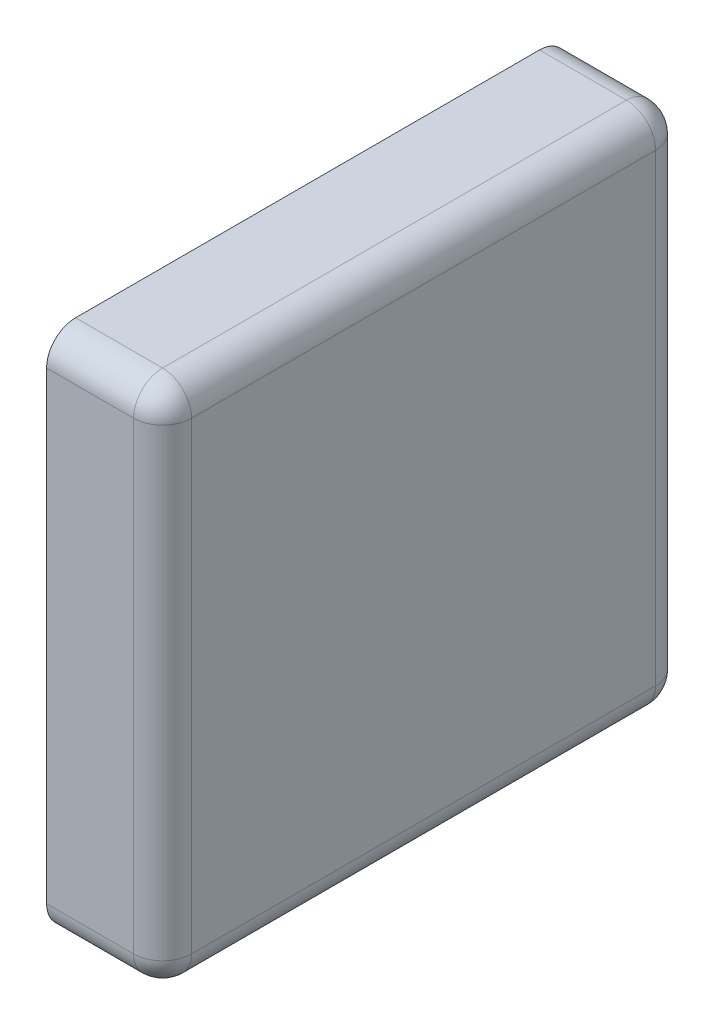
ISO-10303-21;
HEADER;
FILE_DESCRIPTION(('STEP AP214'),'2;1');
FILE_NAME('part.step','',(''),(''),'','','');
FILE_SCHEMA(('AUTOMOTIVE_DESIGN { 1 0 10303 214 1 1 1 1 }'));
ENDSEC;
DATA;
#1=APPLICATION_CONTEXT('core data for automotive mechanical design processes');
#2=APPLICATION_PROTOCOL_DEFINITION('international standard','automotive_design',2000,#1);
#3=PRODUCT_CONTEXT('',#1,'mechanical');
#4=PRODUCT('Part','Part','',(#3));
#5=PRODUCT_RELATED_PRODUCT_CATEGORY('part','',(#4));
#6=PRODUCT_DEFINITION_FORMATION('','',#4);
#7=PRODUCT_DEFINITION_CONTEXT('part definition',#1,'design');
#8=PRODUCT_DEFINITION('design','',#6,#7);
#9=PRODUCT_DEFINITION_SHAPE('','',#8);
#10=(LENGTH_UNIT() NAMED_UNIT(*) SI_UNIT(.MILLI.,.METRE.));
#11=(NAMED_UNIT(*) PLANE_ANGLE_UNIT() SI_UNIT($,.RADIAN.));
#12=(NAMED_UNIT(*) SI_UNIT($,.STERADIAN.) SOLID_ANGLE_UNIT());
#13=UNCERTAINTY_MEASURE_WITH_UNIT(LENGTH_MEASURE(1.E-05),#10,'distance_accuracy_value','');
#14=(GEOMETRIC_REPRESENTATION_CONTEXT(3) GLOBAL_UNCERTAINTY_ASSIGNED_CONTEXT((#13)) GLOBAL_UNIT_ASSIGNED_CONTEXT((#10,
#11,#12)) REPRESENTATION_CONTEXT('',''));
#15=CARTESIAN_POINT('',(0.,0.,0.));
#16=DIRECTION('',(0.,0.,1.));
#17=DIRECTION('',(1.,0.,0.));
#18=AXIS2_PLACEMENT_3D('',#15,#16,#17);
#19=CARTESIAN_POINT('',(1.7,0.,0.));
#20=DIRECTION('',(1.,0.,0.));
#21=DIRECTION('',(0.,0.,-1.));
#22=AXIS2_PLACEMENT_3D('',#19,#20,#21);
#23=PLANE('',#22);
#24=DIRECTION('',(0.,0.,1.));
#25=VECTOR('',#24,1.);
#26=CARTESIAN_POINT('',(1.7,0.85,0.));
#27=LINE('',#26,#25);
#28=CARTESIAN_POINT('',(1.7,0.85,0.85));
#29=VERTEX_POINT('',#28);
#30=CARTESIAN_POINT('',(1.7,0.85,0.05));
#31=VERTEX_POINT('',#30);
#32=EDGE_CURVE('E175',#29,#31,#27,.F.);
#33=ORIENTED_EDGE('',*,*,#32,.F.);
#34=DIRECTION('',(0.,1.,0.));
#35=VECTOR('',#34,1.);
#36=CARTESIAN_POINT('',(1.7,0.,0.85));
#37=LINE('',#36,#35);
#38=CARTESIAN_POINT('',(1.7,0.05,0.85));
#39=VERTEX_POINT('',#38);
#40=EDGE_CURVE('E165',#39,#29,#37,.T.);
#41=ORIENTED_EDGE('',*,*,#40,.F.);
#42=DIRECTION('',(0.,0.,1.));
#43=VECTOR('',#42,1.);
#44=CARTESIAN_POINT('',(1.7,0.05,0.));
#45=LINE('',#44,#43);
#46=CARTESIAN_POINT('',(1.7,0.05,0.05));
#47=VERTEX_POINT('',#46);
#48=EDGE_CURVE('E211',#47,#39,#45,.T.);
#49=ORIENTED_EDGE('',*,*,#48,.F.);
#50=DIRECTION('',(0.,1.,0.));
#51=VECTOR('',#50,1.);
#52=CARTESIAN_POINT('',(1.7,0.,0.05));
#53=LINE('',#52,#51);
#54=EDGE_CURVE('E227',#31,#47,#53,.F.);
#55=ORIENTED_EDGE('',*,*,#54,.F.);
#56=EDGE_LOOP('',(#33,#41,#49,#55));
#57=FACE_BOUND('',#56,.T.);
#58=ADVANCED_FACE('F17',(#57),#23,.T.);
#59=CARTESIAN_POINT('',(1.65,0.05,0.));
#60=DIRECTION('',(0.,0.,1.));
#61=DIRECTION('',(1.,0.,0.));
#62=AXIS2_PLACEMENT_3D('',#59,#60,#61);
#63=CYLINDRICAL_SURFACE('',#62,0.05);
#64=CARTESIAN_POINT('',(1.65,0.05,0.05));
#65=DIRECTION('',(0.,-9.5846697953635E-13,-1.));
#66=DIRECTION('',(1.,0.,0.));
#67=AXIS2_PLACEMENT_3D('',#64,#65,#66);
#68=CIRCLE('',#67,0.05);
#69=CARTESIAN_POINT('',(1.65,0.,0.050000000000012));
#70=VERTEX_POINT('',#69);
#71=EDGE_CURVE('E207',#47,#70,#68,.T.);
#72=ORIENTED_EDGE('',*,*,#71,.F.);
#73=ORIENTED_EDGE('',*,*,#48,.T.);
#74=CARTESIAN_POINT('',(1.65,0.05,0.85));
#75=DIRECTION('',(0.,0.,-1.));
#76=DIRECTION('',(1.,0.,0.));
#77=AXIS2_PLACEMENT_3D('',#74,#75,#76);
#78=CIRCLE('',#77,0.05);
#79=CARTESIAN_POINT('',(1.65,0.,0.85));
#80=VERTEX_POINT('',#79);
#81=EDGE_CURVE('E284',#80,#39,#78,.F.);
#82=ORIENTED_EDGE('',*,*,#81,.F.);
#83=DIRECTION('',(0.,0.,1.));
#84=VECTOR('',#83,1.);
#85=CARTESIAN_POINT('',(1.65,0.,0.));
#86=LINE('',#85,#84);
#87=EDGE_CURVE('E289',#80,#70,#86,.F.);
#88=ORIENTED_EDGE('',*,*,#87,.T.);
#89=EDGE_LOOP('',(#72,#73,#82,#88));
#90=FACE_BOUND('',#89,.T.);
#91=ADVANCED_FACE('F200',(#90),#63,.T.);
#92=CARTESIAN_POINT('',(1.65,0.05,0.05));
#93=DIRECTION('',(1.,0.,0.));
#94=DIRECTION('',(0.,1.,0.));
#95=AXIS2_PLACEMENT_3D('',#92,#93,#94);
#96=SPHERICAL_SURFACE('',#95,0.05);
#97=CARTESIAN_POINT('',(1.65,0.05,0.05));
#98=DIRECTION('',(1.,0.,0.));
#99=DIRECTION('',(0.,0.,-1.));
#100=AXIS2_PLACEMENT_3D('',#97,#98,#99);
#101=CIRCLE('',#100,0.05);
#102=CARTESIAN_POINT('',(1.65,0.05,0.));
#103=VERTEX_POINT('',#102);
#104=EDGE_CURVE('E124',#103,#70,#101,.F.);
#105=ORIENTED_EDGE('',*,*,#104,.F.);
#106=CARTESIAN_POINT('',(1.65,0.05,0.05));
#107=DIRECTION('',(0.,1.,0.));
#108=DIRECTION('',(0.,0.,1.));
#109=AXIS2_PLACEMENT_3D('',#106,#107,#108);
#110=CIRCLE('',#109,0.05);
#111=EDGE_CURVE('E210',#47,#103,#110,.T.);
#112=ORIENTED_EDGE('',*,*,#111,.F.);
#113=ORIENTED_EDGE('',*,*,#71,.T.);
#114=EDGE_LOOP('',(#105,#112,#113));
#115=FACE_BOUND('',#114,.T.);
#116=ADVANCED_FACE('F196',(#115),#96,.T.);
#117=CARTESIAN_POINT('',(1.65,0.,0.05));
#118=DIRECTION('',(0.,1.,0.));
#119=DIRECTION('',(0.,0.,1.));
#120=AXIS2_PLACEMENT_3D('',#117,#118,#119);
#121=CYLINDRICAL_SURFACE('',#120,0.05);
#122=CARTESIAN_POINT('',(1.65,0.85,0.05));
#123=DIRECTION('',(0.,1.,-7.66605163745165E-12));
#124=DIRECTION('',(1.,0.,0.));
#125=AXIS2_PLACEMENT_3D('',#122,#123,#124);
#126=CIRCLE('',#125,0.05);
#127=CARTESIAN_POINT('',(1.65,0.849999999999904,0.));
#128=VERTEX_POINT('',#127);
#129=EDGE_CURVE('E187',#31,#128,#126,.T.);
#130=ORIENTED_EDGE('',*,*,#129,.F.);
#131=ORIENTED_EDGE('',*,*,#54,.T.);
#132=ORIENTED_EDGE('',*,*,#111,.T.);
#133=DIRECTION('',(0.,1.,0.));
#134=VECTOR('',#133,1.);
#135=CARTESIAN_POINT('',(1.65,0.,0.));
#136=LINE('',#135,#134);
#137=EDGE_CURVE('E74',#103,#128,#136,.T.);
#138=ORIENTED_EDGE('',*,*,#137,.T.);
#139=EDGE_LOOP('',(#130,#131,#132,#138));
#140=FACE_BOUND('',#139,.T.);
#141=ADVANCED_FACE('F192',(#140),#121,.T.);
#142=CARTESIAN_POINT('',(1.65,0.85,0.05));
#143=DIRECTION('',(1.,0.,0.));
#144=DIRECTION('',(0.,1.,0.));
#145=AXIS2_PLACEMENT_3D('',#142,#143,#144);
#146=SPHERICAL_SURFACE('',#145,0.05);
#147=CARTESIAN_POINT('',(1.65,0.85,0.05));
#148=DIRECTION('',(1.,0.,0.));
#149=DIRECTION('',(0.,0.,-1.));
#150=AXIS2_PLACEMENT_3D('',#147,#148,#149);
#151=CIRCLE('',#150,0.05);
#152=CARTESIAN_POINT('',(1.65,0.9,0.05));
#153=VERTEX_POINT('',#152);
#154=EDGE_CURVE('E118',#153,#128,#151,.F.);
#155=ORIENTED_EDGE('',*,*,#154,.F.);
#156=CARTESIAN_POINT('',(1.65,0.85,0.05));
#157=DIRECTION('',(0.,0.,1.));
#158=DIRECTION('',(1.,0.,0.));
#159=AXIS2_PLACEMENT_3D('',#156,#157,#158);
#160=CIRCLE('',#159,0.05);
#161=EDGE_CURVE('E166',#31,#153,#160,.T.);
#162=ORIENTED_EDGE('',*,*,#161,.F.);
#163=ORIENTED_EDGE('',*,*,#129,.T.);
#164=EDGE_LOOP('',(#155,#162,#163));
#165=FACE_BOUND('',#164,.T.);
#166=ADVANCED_FACE('F189',(#165),#146,.T.);
#167=CARTESIAN_POINT('',(1.65,0.85,0.));
#168=DIRECTION('',(0.,0.,1.));
#169=DIRECTION('',(1.,0.,0.));
#170=AXIS2_PLACEMENT_3D('',#167,#168,#169);
#171=CYLINDRICAL_SURFACE('',#170,0.05);
#172=DIRECTION('',(0.,0.,1.));
#173=VECTOR('',#172,1.);
#174=CARTESIAN_POINT('',(1.65,0.9,0.));
#175=LINE('',#174,#173);
#176=CARTESIAN_POINT('',(1.65,0.9,0.849999999999904));
#177=VERTEX_POINT('',#176);
#178=EDGE_CURVE('E109',#177,#153,#175,.F.);
#179=ORIENTED_EDGE('',*,*,#178,.F.);
#180=CARTESIAN_POINT('',(1.65,0.85,0.85));
#181=DIRECTION('',(0.,7.66605163745165E-12,1.));
#182=DIRECTION('',(1.,0.,0.));
#183=AXIS2_PLACEMENT_3D('',#180,#181,#182);
#184=CIRCLE('',#183,0.05);
#185=EDGE_CURVE('E162',#29,#177,#184,.T.);
#186=ORIENTED_EDGE('',*,*,#185,.F.);
#187=ORIENTED_EDGE('',*,*,#32,.T.);
#188=ORIENTED_EDGE('',*,*,#161,.T.);
#189=EDGE_LOOP('',(#179,#186,#187,#188));
#190=FACE_BOUND('',#189,.T.);
#191=ADVANCED_FACE('F154',(#190),#171,.T.);
#192=CARTESIAN_POINT('',(1.65,0.85,0.85));
#193=DIRECTION('',(1.,0.,0.));
#194=DIRECTION('',(0.,0.,1.));
#195=AXIS2_PLACEMENT_3D('',#192,#193,#194);
#196=SPHERICAL_SURFACE('',#195,0.05);
#197=CARTESIAN_POINT('',(1.65,0.85,0.85));
#198=DIRECTION('',(1.,0.,0.));
#199=DIRECTION('',(0.,0.,-1.));
#200=AXIS2_PLACEMENT_3D('',#197,#198,#199);
#201=CIRCLE('',#200,0.05);
#202=CARTESIAN_POINT('',(1.65,0.85,0.9));
#203=VERTEX_POINT('',#202);
#204=EDGE_CURVE('E108',#203,#177,#201,.F.);
#205=ORIENTED_EDGE('',*,*,#204,.F.);
#206=CARTESIAN_POINT('',(1.65,0.85,0.85));
#207=DIRECTION('',(0.,1.,0.));
#208=DIRECTION('',(0.,0.,1.));
#209=AXIS2_PLACEMENT_3D('',#206,#207,#208);
#210=CIRCLE('',#209,0.05);
#211=EDGE_CURVE('E220',#29,#203,#210,.F.);
#212=ORIENTED_EDGE('',*,*,#211,.F.);
#213=ORIENTED_EDGE('',*,*,#185,.T.);
#214=EDGE_LOOP('',(#205,#212,#213));
#215=FACE_BOUND('',#214,.T.);
#216=ADVANCED_FACE('F149',(#215),#196,.T.);
#217=CARTESIAN_POINT('',(1.65,0.,0.85));
#218=DIRECTION('',(0.,1.,0.));
#219=DIRECTION('',(0.,0.,1.));
#220=AXIS2_PLACEMENT_3D('',#217,#218,#219);
#221=CYLINDRICAL_SURFACE('',#220,0.05);
#222=DIRECTION('',(0.,1.,0.));
#223=VECTOR('',#222,1.);
#224=CARTESIAN_POINT('',(1.65,0.,0.9));
#225=LINE('',#224,#223);
#226=CARTESIAN_POINT('',(1.65,0.05,0.9));
#227=VERTEX_POINT('',#226);
#228=EDGE_CURVE('E103',#227,#203,#225,.T.);
#229=ORIENTED_EDGE('',*,*,#228,.F.);
#230=CARTESIAN_POINT('',(1.65,0.05,0.85));
#231=DIRECTION('',(0.,-1.,0.));
#232=DIRECTION('',(1.,0.,0.));
#233=AXIS2_PLACEMENT_3D('',#230,#231,#232);
#234=CIRCLE('',#233,0.05);
#235=EDGE_CURVE('E136',#39,#227,#234,.T.);
#236=ORIENTED_EDGE('',*,*,#235,.F.);
#237=ORIENTED_EDGE('',*,*,#40,.T.);
#238=ORIENTED_EDGE('',*,*,#211,.T.);
#239=EDGE_LOOP('',(#229,#236,#237,#238));
#240=FACE_BOUND('',#239,.T.);
#241=ADVANCED_FACE('F144',(#240),#221,.T.);
#242=CARTESIAN_POINT('',(1.65,0.05,0.85));
#243=DIRECTION('',(1.,0.,0.));
#244=DIRECTION('',(0.,-1.,0.));
#245=AXIS2_PLACEMENT_3D('',#242,#243,#244);
#246=SPHERICAL_SURFACE('',#245,0.05);
#247=CARTESIAN_POINT('',(1.65,0.05,0.85));
#248=DIRECTION('',(1.,0.,0.));
#249=DIRECTION('',(0.,0.,-1.));
#250=AXIS2_PLACEMENT_3D('',#247,#248,#249);
#251=CIRCLE('',#250,0.05);
#252=EDGE_CURVE('E90',#80,#227,#251,.F.);
#253=ORIENTED_EDGE('',*,*,#252,.F.);
#254=ORIENTED_EDGE('',*,*,#81,.T.);
#255=ORIENTED_EDGE('',*,*,#235,.T.);
#256=EDGE_LOOP('',(#253,#254,#255));
#257=FACE_BOUND('',#256,.T.);
#258=ADVANCED_FACE('F139',(#257),#246,.T.);
#259=CARTESIAN_POINT('',(0.,0.,0.));
#260=DIRECTION('',(0.,1.,0.));
#261=DIRECTION('',(0.,0.,1.));
#262=AXIS2_PLACEMENT_3D('',#259,#260,#261);
#263=PLANE('',#262);
#264=DIRECTION('',(1.,0.,0.));
#265=VECTOR('',#264,1.);
#266=CARTESIAN_POINT('',(0.,0.,0.85));
#267=LINE('',#266,#265);
#268=CARTESIAN_POINT('',(1.5,0.,0.85));
#269=VERTEX_POINT('',#268);
#270=EDGE_CURVE('E96',#269,#80,#267,.T.);
#271=ORIENTED_EDGE('',*,*,#270,.F.);
#272=DIRECTION('',(0.,0.,-1.));
#273=VECTOR('',#272,1.);
#274=CARTESIAN_POINT('',(1.5,0.,0.));
#275=LINE('',#274,#273);
#276=CARTESIAN_POINT('',(1.5,0.,0.05));
#277=VERTEX_POINT('',#276);
#278=EDGE_CURVE('E86',#269,#277,#275,.T.);
#279=ORIENTED_EDGE('',*,*,#278,.T.);
#280=DIRECTION('',(1.,0.,0.));
#281=VECTOR('',#280,1.);
#282=CARTESIAN_POINT('',(0.,0.,0.05));
#283=LINE('',#282,#281);
#284=EDGE_CURVE('E60',#70,#277,#283,.F.);
#285=ORIENTED_EDGE('',*,*,#284,.F.);
#286=ORIENTED_EDGE('',*,*,#87,.F.);
#287=EDGE_LOOP('',(#271,#279,#285,#286));
#288=FACE_BOUND('',#287,.T.);
#289=ADVANCED_FACE('F143',(#288),#263,.F.);
#290=CARTESIAN_POINT('',(0.,0.05,0.05));
#291=DIRECTION('',(1.,0.,0.));
#292=DIRECTION('',(0.,0.,-1.));
#293=AXIS2_PLACEMENT_3D('',#290,#291,#292);
#294=CYLINDRICAL_SURFACE('',#293,0.05);
#295=ORIENTED_EDGE('',*,*,#104,.T.);
#296=ORIENTED_EDGE('',*,*,#284,.T.);
#297=CARTESIAN_POINT('',(1.5,0.05,0.05));
#298=DIRECTION('',(1.,0.,0.));
#299=DIRECTION('',(0.,0.,-1.));
#300=AXIS2_PLACEMENT_3D('',#297,#298,#299);
#301=CIRCLE('',#300,0.05);
#302=CARTESIAN_POINT('',(1.5,0.05,0.));
#303=VERTEX_POINT('',#302);
#304=EDGE_CURVE('E20',#277,#303,#301,.T.);
#305=ORIENTED_EDGE('',*,*,#304,.T.);
#306=DIRECTION('',(1.,0.,0.));
#307=VECTOR('',#306,1.);
#308=CARTESIAN_POINT('',(0.,0.05,0.));
#309=LINE('',#308,#307);
#310=EDGE_CURVE('E67',#303,#103,#309,.T.);
#311=ORIENTED_EDGE('',*,*,#310,.T.);
#312=EDGE_LOOP('',(#295,#296,#305,#311));
#313=FACE_BOUND('',#312,.T.);
#314=ADVANCED_FACE('F85',(#313),#294,.T.);
#315=CARTESIAN_POINT('',(0.,0.,0.));
#316=DIRECTION('',(0.,0.,1.));
#317=DIRECTION('',(1.,0.,0.));
#318=AXIS2_PLACEMENT_3D('',#315,#316,#317);
#319=PLANE('',#318);
#320=ORIENTED_EDGE('',*,*,#137,.F.);
#321=ORIENTED_EDGE('',*,*,#310,.F.);
#322=DIRECTION('',(0.,1.,0.));
#323=VECTOR('',#322,1.);
#324=CARTESIAN_POINT('',(1.5,0.,0.));
#325=LINE('',#324,#323);
#326=CARTESIAN_POINT('',(1.5,0.85,0.));
#327=VERTEX_POINT('',#326);
#328=EDGE_CURVE('E71',#303,#327,#325,.T.);
#329=ORIENTED_EDGE('',*,*,#328,.T.);
#330=DIRECTION('',(1.,0.,0.));
#331=VECTOR('',#330,1.);
#332=CARTESIAN_POINT('',(0.,0.85,0.));
#333=LINE('',#332,#331);
#334=EDGE_CURVE('E114',#128,#327,#333,.F.);
#335=ORIENTED_EDGE('',*,*,#334,.F.);
#336=EDGE_LOOP('',(#320,#321,#329,#335));
#337=FACE_BOUND('',#336,.T.);
#338=ADVANCED_FACE('F69',(#337),#319,.F.);
#339=CARTESIAN_POINT('',(0.,0.85,0.05));
#340=DIRECTION('',(1.,0.,0.));
#341=DIRECTION('',(0.,0.,-1.));
#342=AXIS2_PLACEMENT_3D('',#339,#340,#341);
#343=CYLINDRICAL_SURFACE('',#342,0.05);
#344=ORIENTED_EDGE('',*,*,#334,.T.);
#345=CARTESIAN_POINT('',(1.5,0.85,0.05));
#346=DIRECTION('',(1.,0.,0.));
#347=DIRECTION('',(0.,0.,-1.));
#348=AXIS2_PLACEMENT_3D('',#345,#346,#347);
#349=CIRCLE('',#348,0.05);
#350=CARTESIAN_POINT('',(1.5,0.9,0.05));
#351=VERTEX_POINT('',#350);
#352=EDGE_CURVE('E83',#327,#351,#349,.T.);
#353=ORIENTED_EDGE('',*,*,#352,.T.);
#354=DIRECTION('',(1.,0.,0.));
#355=VECTOR('',#354,1.);
#356=CARTESIAN_POINT('',(0.,0.9,0.05));
#357=LINE('',#356,#355);
#358=EDGE_CURVE('E112',#153,#351,#357,.F.);
#359=ORIENTED_EDGE('',*,*,#358,.F.);
#360=ORIENTED_EDGE('',*,*,#154,.T.);
#361=EDGE_LOOP('',(#344,#353,#359,#360));
#362=FACE_BOUND('',#361,.T.);
#363=ADVANCED_FACE('F312',(#362),#343,.T.);
#364=CARTESIAN_POINT('',(0.,0.9,0.));
#365=DIRECTION('',(0.,1.,0.));
#366=DIRECTION('',(0.,0.,1.));
#367=AXIS2_PLACEMENT_3D('',#364,#365,#366);
#368=PLANE('',#367);
#369=DIRECTION('',(1.,0.,0.));
#370=VECTOR('',#369,1.);
#371=CARTESIAN_POINT('',(0.,0.9,0.85));
#372=LINE('',#371,#370);
#373=CARTESIAN_POINT('',(1.5,0.9,0.85));
#374=VERTEX_POINT('',#373);
#375=EDGE_CURVE('E106',#177,#374,#372,.F.);
#376=ORIENTED_EDGE('',*,*,#375,.F.);
#377=ORIENTED_EDGE('',*,*,#178,.T.);
#378=ORIENTED_EDGE('',*,*,#358,.T.);
#379=DIRECTION('',(0.,0.,-1.));
#380=VECTOR('',#379,1.);
#381=CARTESIAN_POINT('',(1.5,0.9,0.));
#382=LINE('',#381,#380);
#383=EDGE_CURVE('E234',#351,#374,#382,.F.);
#384=ORIENTED_EDGE('',*,*,#383,.T.);
#385=EDGE_LOOP('',(#376,#377,#378,#384));
#386=FACE_BOUND('',#385,.T.);
#387=ADVANCED_FACE('F252',(#386),#368,.T.);
#388=CARTESIAN_POINT('',(0.,0.85,0.85));
#389=DIRECTION('',(1.,0.,0.));
#390=DIRECTION('',(0.,0.,-1.));
#391=AXIS2_PLACEMENT_3D('',#388,#389,#390);
#392=CYLINDRICAL_SURFACE('',#391,0.05);
#393=DIRECTION('',(1.,0.,0.));
#394=VECTOR('',#393,1.);
#395=CARTESIAN_POINT('',(0.,0.85,0.9));
#396=LINE('',#395,#394);
#397=CARTESIAN_POINT('',(1.5,0.85,0.9));
#398=VERTEX_POINT('',#397);
#399=EDGE_CURVE('E99',#203,#398,#396,.F.);
#400=ORIENTED_EDGE('',*,*,#399,.F.);
#401=ORIENTED_EDGE('',*,*,#204,.T.);
#402=ORIENTED_EDGE('',*,*,#375,.T.);
#403=CARTESIAN_POINT('',(1.5,0.85,0.85));
#404=DIRECTION('',(1.,0.,0.));
#405=DIRECTION('',(0.,0.,-1.));
#406=AXIS2_PLACEMENT_3D('',#403,#404,#405);
#407=CIRCLE('',#406,0.05);
#408=EDGE_CURVE('E232',#374,#398,#407,.T.);
#409=ORIENTED_EDGE('',*,*,#408,.T.);
#410=EDGE_LOOP('',(#400,#401,#402,#409));
#411=FACE_BOUND('',#410,.T.);
#412=ADVANCED_FACE('F247',(#411),#392,.T.);
#413=CARTESIAN_POINT('',(0.,0.,0.9));
#414=DIRECTION('',(0.,0.,1.));
#415=DIRECTION('',(1.,0.,0.));
#416=AXIS2_PLACEMENT_3D('',#413,#414,#415);
#417=PLANE('',#416);
#418=ORIENTED_EDGE('',*,*,#228,.T.);
#419=ORIENTED_EDGE('',*,*,#399,.T.);
#420=DIRECTION('',(0.,1.,0.));
#421=VECTOR('',#420,1.);
#422=CARTESIAN_POINT('',(1.5,0.,0.9));
#423=LINE('',#422,#421);
#424=CARTESIAN_POINT('',(1.5,0.05,0.9));
#425=VERTEX_POINT('',#424);
#426=EDGE_CURVE('E26',#398,#425,#423,.F.);
#427=ORIENTED_EDGE('',*,*,#426,.T.);
#428=DIRECTION('',(1.,0.,0.));
#429=VECTOR('',#428,1.);
#430=CARTESIAN_POINT('',(0.,0.05,0.9));
#431=LINE('',#430,#429);
#432=EDGE_CURVE('E34',#227,#425,#431,.F.);
#433=ORIENTED_EDGE('',*,*,#432,.F.);
#434=EDGE_LOOP('',(#418,#419,#427,#433));
#435=FACE_BOUND('',#434,.T.);
#436=ADVANCED_FACE('F243',(#435),#417,.T.);
#437=CARTESIAN_POINT('',(0.,0.05,0.85));
#438=DIRECTION('',(1.,0.,0.));
#439=DIRECTION('',(0.,0.,-1.));
#440=AXIS2_PLACEMENT_3D('',#437,#438,#439);
#441=CYLINDRICAL_SURFACE('',#440,0.05);
#442=ORIENTED_EDGE('',*,*,#432,.T.);
#443=CARTESIAN_POINT('',(1.5,0.05,0.85));
#444=DIRECTION('',(1.,0.,0.));
#445=DIRECTION('',(0.,0.,-1.));
#446=AXIS2_PLACEMENT_3D('',#443,#444,#445);
#447=CIRCLE('',#446,0.05);
#448=EDGE_CURVE('E11',#425,#269,#447,.T.);
#449=ORIENTED_EDGE('',*,*,#448,.T.);
#450=ORIENTED_EDGE('',*,*,#270,.T.);
#451=ORIENTED_EDGE('',*,*,#252,.T.);
#452=EDGE_LOOP('',(#442,#449,#450,#451));
#453=FACE_BOUND('',#452,.T.);
#454=ADVANCED_FACE('F323',(#453),#441,.T.);
#455=CARTESIAN_POINT('',(1.5,0.,0.));
#456=DIRECTION('',(1.,0.,0.));
#457=DIRECTION('',(0.,0.,-1.));
#458=AXIS2_PLACEMENT_3D('',#455,#456,#457);
#459=PLANE('',#458);
#460=ORIENTED_EDGE('',*,*,#426,.F.);
#461=ORIENTED_EDGE('',*,*,#408,.F.);
#462=ORIENTED_EDGE('',*,*,#383,.F.);
#463=ORIENTED_EDGE('',*,*,#352,.F.);
#464=ORIENTED_EDGE('',*,*,#328,.F.);
#465=ORIENTED_EDGE('',*,*,#304,.F.);
#466=ORIENTED_EDGE('',*,*,#278,.F.);
#467=ORIENTED_EDGE('',*,*,#448,.F.);
#468=EDGE_LOOP('',(#460,#461,#462,#463,#464,#465,#466,#467));
#469=FACE_BOUND('',#468,.T.);
#470=ADVANCED_FACE('F79',(#469),#459,.F.);
#471=CLOSED_SHELL('',(#58,#91,#116,#141,#166,#191,#216,#241,#258,#289,#314,#338,#363,#387,#412,
#436,#454,#470));
#472=MANIFOLD_SOLID_BREP('B1',#471);
#473=ADVANCED_BREP_SHAPE_REPRESENTATION('',(#18,#472),#14);
#474=SHAPE_DEFINITION_REPRESENTATION(#9,#473);
ENDSEC;
END-ISO-10303-21;
